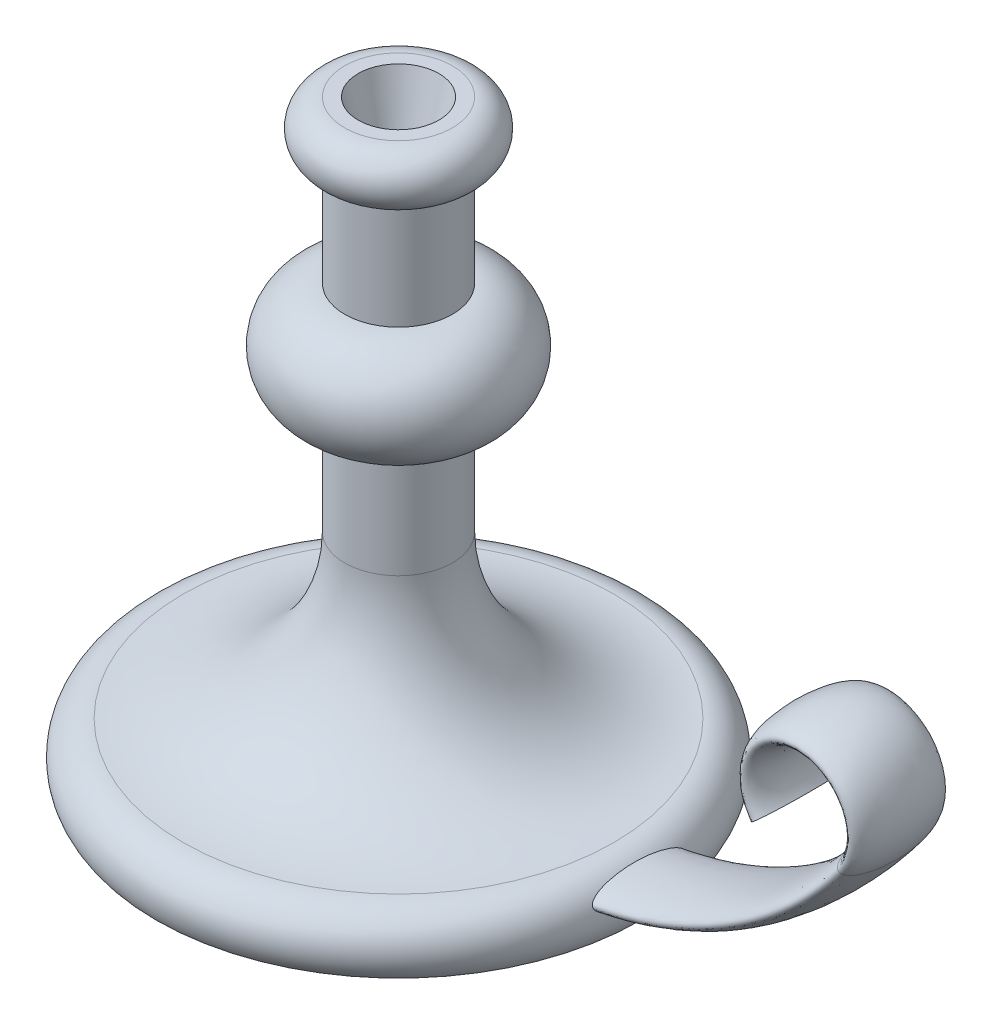
ISO-10303-21;
HEADER;
FILE_DESCRIPTION(('STEP AP214'),'2;1');
FILE_NAME('part.step','',(''),(''),'','','');
FILE_SCHEMA(('AUTOMOTIVE_DESIGN { 1 0 10303 214 1 1 1 1 }'));
ENDSEC;
DATA;
#1=APPLICATION_CONTEXT('core data for automotive mechanical design processes');
#2=APPLICATION_PROTOCOL_DEFINITION('international standard','automotive_design',2000,#1);
#3=PRODUCT_CONTEXT('',#1,'mechanical');
#4=PRODUCT('Part','Part','',(#3));
#5=PRODUCT_RELATED_PRODUCT_CATEGORY('part','',(#4));
#6=PRODUCT_DEFINITION_FORMATION('','',#4);
#7=PRODUCT_DEFINITION_CONTEXT('part definition',#1,'design');
#8=PRODUCT_DEFINITION('design','',#6,#7);
#9=PRODUCT_DEFINITION_SHAPE('','',#8);
#10=(LENGTH_UNIT() NAMED_UNIT(*) SI_UNIT(.MILLI.,.METRE.));
#11=(NAMED_UNIT(*) PLANE_ANGLE_UNIT() SI_UNIT($,.RADIAN.));
#12=(NAMED_UNIT(*) SI_UNIT($,.STERADIAN.) SOLID_ANGLE_UNIT());
#13=UNCERTAINTY_MEASURE_WITH_UNIT(LENGTH_MEASURE(1.E-05),#10,'distance_accuracy_value','');
#14=(GEOMETRIC_REPRESENTATION_CONTEXT(3) GLOBAL_UNCERTAINTY_ASSIGNED_CONTEXT((#13)) GLOBAL_UNIT_ASSIGNED_CONTEXT((#10,
#11,#12)) REPRESENTATION_CONTEXT('',''));
#15=CARTESIAN_POINT('',(0.,0.,0.));
#16=DIRECTION('',(0.,0.,1.));
#17=DIRECTION('',(1.,0.,0.));
#18=AXIS2_PLACEMENT_3D('',#15,#16,#17);
#19=CARTESIAN_POINT('',(0.,0.,0.));
#20=DIRECTION('',(0.,1.,0.));
#21=DIRECTION('',(-1.,0.,0.));
#22=AXIS2_PLACEMENT_3D('',#19,#20,#21);
#23=PLANE('',#22);
#24=CARTESIAN_POINT('',(0.,0.,0.));
#25=DIRECTION('',(0.,1.,0.));
#26=DIRECTION('',(-1.,0.,0.));
#27=AXIS2_PLACEMENT_3D('',#24,#25,#26);
#28=CIRCLE('',#27,90.);
#29=CARTESIAN_POINT('',(-90.,0.,0.));
#30=VERTEX_POINT('',#29);
#31=EDGE_CURVE('E10',#30,#30,#28,.T.);
#32=ORIENTED_EDGE('',*,*,#31,.F.);
#33=EDGE_LOOP('',(#32));
#34=FACE_BOUND('',#33,.T.);
#35=ADVANCED_FACE('F41',(#34),#23,.F.);
#36=CARTESIAN_POINT('',(0.,7.50000000000001,0.));
#37=DIRECTION('',(0.,1.,0.));
#38=DIRECTION('',(-1.,0.,0.));
#39=AXIS2_PLACEMENT_3D('',#36,#37,#38);
#40=TOROIDAL_SURFACE('',#39,80.,12.5);
#41=CARTESIAN_POINT('',(89.6510583005493,12.75205108181,-17.5));
#42=CARTESIAN_POINT('',(89.6712265763763,12.7092993159367,-17.5000023257605));
#43=CARTESIAN_POINT('',(89.6914975939778,12.6666087054796,-17.4977898460739));
#44=CARTESIAN_POINT('',(89.7320874389002,12.5816896807748,-17.489042516584));
#45=CARTESIAN_POINT('',(89.7524062765804,12.5394613805785,-17.4825066235818));
#46=CARTESIAN_POINT('',(89.8132291654997,12.4138963752756,-17.4566823122405));
#47=CARTESIAN_POINT('',(89.8535811376786,12.3317186792987,-17.4311775547004));
#48=CARTESIAN_POINT('',(89.9443453739195,12.1492597562581,-17.3569168690905));
#49=CARTESIAN_POINT('',(89.9942714449003,12.0506619677684,-17.3035566931432));
#50=CARTESIAN_POINT('',(90.0909200299712,11.8627264308283,-17.1801991938799));
#51=CARTESIAN_POINT('',(90.1376341652617,11.7734126121458,-17.1101603369399));
#52=CARTESIAN_POINT('',(90.2223487227239,11.6137425903827,-16.9676062334601));
#53=CARTESIAN_POINT('',(90.2607228043343,11.5423969039705,-16.8963913052705));
#54=CARTESIAN_POINT('',(90.3351432934568,11.4056514014049,-16.747283136507));
#55=CARTESIAN_POINT('',(90.3711876981154,11.3402566821814,-16.6693842801231));
#56=CARTESIAN_POINT('',(90.4412170587481,11.2145880599871,-16.5084804268841));
#57=CARTESIAN_POINT('',(90.4751982003763,11.1543235632542,-16.4254665121922));
#58=CARTESIAN_POINT('',(90.5412559337422,11.0383657298657,-16.2556442319927));
#59=CARTESIAN_POINT('',(90.5733330734153,10.9826710763151,-16.1688369707459));
#60=CARTESIAN_POINT('',(90.640166352336,10.8677355176353,-15.9798901509853));
#61=CARTESIAN_POINT('',(90.6746704292232,10.8090867133352,-15.8773032324495));
#62=CARTESIAN_POINT('',(90.7417471088615,10.6962171927003,-15.6691101574303));
#63=CARTESIAN_POINT('',(90.7743194876529,10.6419969895406,-15.5635036529535));
#64=CARTESIAN_POINT('',(90.8376895317237,10.5374998307884,-15.350067821134));
#65=CARTESIAN_POINT('',(90.8684899267248,10.4872167644531,-15.2422422801763));
#66=CARTESIAN_POINT('',(90.9285408142655,10.3900402750948,-15.0246665691671));
#67=CARTESIAN_POINT('',(90.9577914004017,10.3431466473131,-14.9149165158755));
#68=CARTESIAN_POINT('',(91.0246635628972,10.2368198687245,-14.6559701838914));
#69=CARTESIAN_POINT('',(91.061722080739,10.1785909098826,-14.5061344059227));
#70=CARTESIAN_POINT('',(91.1335870249848,10.0668057083414,-14.2041860189743));
#71=CARTESIAN_POINT('',(91.1683931335286,10.0132501247792,-14.0520730923567));
#72=CARTESIAN_POINT('',(91.2360028455176,9.91018679665473,-13.7458493630192));
#73=CARTESIAN_POINT('',(91.268804169249,9.86068363932454,-13.5917365188692));
#74=CARTESIAN_POINT('',(91.33253603699,9.76533126407919,-13.2819971587816));
#75=CARTESIAN_POINT('',(91.363466460807,9.71948228085988,-13.1263705463385));
#76=CARTESIAN_POINT('',(91.4536983491217,9.58679493993947,-12.6574532423924));
#77=CARTESIAN_POINT('',(91.5104092580997,9.5048633897896,-12.3422680572895));
#78=CARTESIAN_POINT('',(91.61804316962,9.35143040996366,-11.7066721837891));
#79=CARTESIAN_POINT('',(91.6689348181267,9.27998494310533,-11.3862429304555));
#80=CARTESIAN_POINT('',(91.7651540531797,9.14647728412906,-10.7428792345334));
#81=CARTESIAN_POINT('',(91.8104858509958,9.08440798174207,-10.4199468875025));
#82=CARTESIAN_POINT('',(91.8960579449448,8.96842286215425,-9.77201667331602));
#83=CARTESIAN_POINT('',(91.9362990382042,8.91450576818339,-9.44701913792827));
#84=CARTESIAN_POINT('',(92.0131335586377,8.81245634458977,-8.78578527026985));
#85=CARTESIAN_POINT('',(92.0495851107734,8.76454046873927,-8.44949923721547));
#86=CARTESIAN_POINT('',(92.1177117765217,8.67567172897244,-7.7755199410008));
#87=CARTESIAN_POINT('',(92.149386710258,8.63471912726916,-7.43782662533742));
#88=CARTESIAN_POINT('',(92.2081691821812,8.55920799650604,-6.76124044657395));
#89=CARTESIAN_POINT('',(92.2352755023287,8.52465117238614,-6.42234728809433));
#90=CARTESIAN_POINT('',(92.285064650059,8.46151611199518,-5.74367662038519));
#91=CARTESIAN_POINT('',(92.3077473303708,8.43293807476635,-5.40389908209456));
#92=CARTESIAN_POINT('',(92.3692408361073,8.35578329845539,-4.38525038846862));
#93=CARTESIAN_POINT('',(92.4016457810741,8.31559696398435,-3.70533407104075));
#94=CARTESIAN_POINT('',(92.449955590497,8.2558981319597,-2.34403032849602));
#95=CARTESIAN_POINT('',(92.465860050928,8.23638614063071,-1.6626428677666));
#96=CARTESIAN_POINT('',(92.4804897563717,8.21843979721509,-0.382065763209342));
#97=CARTESIAN_POINT('',(92.4810642160644,8.21773657036627,0.217072561317909));
#98=CARTESIAN_POINT('',(92.4696811077622,8.23169750318255,1.41514333089417));
#99=CARTESIAN_POINT('',(92.4577216953988,8.24636392450277,2.01407573266662));
#100=CARTESIAN_POINT('',(92.4211061583442,8.29151919787736,3.21115530177056));
#101=CARTESIAN_POINT('',(92.3964460048784,8.32201307054724,3.8093021595266));
#102=CARTESIAN_POINT('',(92.3340382972497,8.39986031775272,5.00464920124046));
#103=CARTESIAN_POINT('',(92.2962728278945,8.44723677346619,5.60184695928692));
#104=CARTESIAN_POINT('',(92.2070825625492,8.56048283851131,6.79336087687234));
#105=CARTESIAN_POINT('',(92.1556613251941,8.62634763011586,7.3876777461316));
#106=CARTESIAN_POINT('',(92.0675758210724,8.74101037935949,8.27583635543225));
#107=CARTESIAN_POINT('',(92.0363972249988,8.78186378186731,8.57126553167506));
#108=CARTESIAN_POINT('',(91.9702100135923,8.86934722368603,9.16083223411257));
#109=CARTESIAN_POINT('',(91.9352015650172,8.91597701149597,9.45496981596568));
#110=CARTESIAN_POINT('',(91.8611213675158,9.01562702160932,10.041784838053));
#111=CARTESIAN_POINT('',(91.8220478701423,9.06864999530318,10.3344615927682));
#112=CARTESIAN_POINT('',(91.7395603454521,9.18184825692315,10.9178628660955));
#113=CARTESIAN_POINT('',(91.6961457601234,9.24202446452802,11.2085871285917));
#114=CARTESIAN_POINT('',(91.6045750054823,9.37057497037419,11.7876875413059));
#115=CARTESIAN_POINT('',(91.5564157377144,9.43895463220846,12.0760620221725));
#116=CARTESIAN_POINT('',(91.4549376357566,9.58514581931861,12.6490942757877));
#117=CARTESIAN_POINT('',(91.4016256799346,9.66294480479529,12.9337564430836));
#118=CARTESIAN_POINT('',(91.289109463467,9.82987994806847,13.4984684048629));
#119=CARTESIAN_POINT('',(91.2299081312627,9.91901047742157,13.7785204117655));
#120=CARTESIAN_POINT('',(91.1359361687135,10.0632286229579,14.1936070549104));
#121=CARTESIAN_POINT('',(91.1037667778025,10.1130293077085,14.3310742271878));
#122=CARTESIAN_POINT('',(91.037518383188,10.2166235564835,14.6040237965658));
#123=CARTESIAN_POINT('',(91.003439557254,10.270416748954,14.7395063769564));
#124=CARTESIAN_POINT('',(90.9291325884481,10.3889894068518,15.0233964139998));
#125=CARTESIAN_POINT('',(90.8886471249461,10.4543215629754,15.1715076215856));
#126=CARTESIAN_POINT('',(90.8046378649289,10.5917063745145,15.4638092429688));
#127=CARTESIAN_POINT('',(90.7611128337781,10.6637617648678,15.6079980300934));
#128=CARTESIAN_POINT('',(90.6707409931795,10.8155883972647,15.8903447400402));
#129=CARTESIAN_POINT('',(90.6239095890323,10.8953244144061,16.0285263387881));
#130=CARTESIAN_POINT('',(90.526151731605,11.064497480463,16.2972288299763));
#131=CARTESIAN_POINT('',(90.4752295627351,11.153924413122,16.4277574959532));
#132=CARTESIAN_POINT('',(90.380545259539,11.3232611559807,16.6492894395697));
#133=CARTESIAN_POINT('',(90.3377700629072,11.4007460716413,16.742553404177));
#134=CARTESIAN_POINT('',(90.248743327797,11.5644963231068,16.9198004175566));
#135=CARTESIAN_POINT('',(90.2024861403342,11.6507760109945,17.0037678141465));
#136=CARTESIAN_POINT('',(90.130045308952,11.7881732532367,17.1198298896557));
#137=CARTESIAN_POINT('',(90.1052099213753,11.8356521269435,17.1570875073887));
#138=CARTESIAN_POINT('',(90.0545914213625,11.9332624809174,17.2272905359315));
#139=CARTESIAN_POINT('',(90.0288081878403,11.9833943004572,17.2602353933223));
#140=CARTESIAN_POINT('',(89.97643336821,12.0861470981112,17.3208258628925));
#141=CARTESIAN_POINT('',(89.949844532771,12.1387598867451,17.3484875703395));
#142=CARTESIAN_POINT('',(89.8959418658494,12.2464030821131,17.3976478755671));
#143=CARTESIAN_POINT('',(89.8686285045834,12.3014319353167,17.4191503686847));
#144=CARTESIAN_POINT('',(89.8037073514862,12.4334576339659,17.461392049419));
#145=CARTESIAN_POINT('',(89.7658783397269,12.5113347633604,17.4791660539871));
#146=CARTESIAN_POINT('',(89.6902412998411,12.6690177324067,17.4997331914999));
#147=CARTESIAN_POINT('',(89.6524332791195,12.7488219802221,17.50253829068));
#148=CARTESIAN_POINT('',(89.577916046245,12.9079933414515,17.4927779408209));
#149=CARTESIAN_POINT('',(89.5412068784035,12.987360437132,17.4802118727887));
#150=CARTESIAN_POINT('',(89.4697808163885,13.1434607717279,17.4409810156745));
#151=CARTESIAN_POINT('',(89.4350660259798,13.2201911962833,17.4143016312908));
#152=CARTESIAN_POINT('',(89.3552959580974,13.3981815957079,17.3366327077017));
#153=CARTESIAN_POINT('',(89.3113771643573,13.4975711590859,17.2802448547764));
#154=CARTESIAN_POINT('',(89.2282993839269,13.6875272252587,17.1511392902752));
#155=CARTESIAN_POINT('',(89.1891597031921,13.7780576658709,17.0783585173073));
#156=CARTESIAN_POINT('',(89.1193050161008,13.9409349439343,16.9302921195295));
#157=CARTESIAN_POINT('',(89.0881372013215,14.0141841015015,16.856187362858));
#158=CARTESIAN_POINT('',(89.0287414929703,14.1545602644834,16.7015966854578));
#159=CARTESIAN_POINT('',(89.0005091294225,14.2216965583286,16.621120805622));
#160=CARTESIAN_POINT('',(88.9463858132425,14.3509486820356,16.4550736615827));
#161=CARTESIAN_POINT('',(88.9205029613336,14.4130470692596,16.3694863387971));
#162=CARTESIAN_POINT('',(88.8707923497112,14.5326798379124,16.1945867260726));
#163=CARTESIAN_POINT('',(88.8469652924514,14.5902126587779,16.1052731782471));
#164=CARTESIAN_POINT('',(88.8009162427218,14.70162843937,15.923187786771));
#165=CARTESIAN_POINT('',(88.7787054915218,14.7554856997481,15.8303974769188));
#166=CARTESIAN_POINT('',(88.7358010812391,14.8596392722484,15.6424886668355));
#167=CARTESIAN_POINT('',(88.7151076880761,14.9099349601462,15.5473697623919));
#168=CARTESIAN_POINT('',(88.6549323320097,15.0562330323469,15.2589640485164));
#169=CARTESIAN_POINT('',(88.6174129301236,15.1475061966202,15.0628635439216));
#170=CARTESIAN_POINT('',(88.5463644133726,15.3199831835958,14.6654752601948));
#171=CARTESIAN_POINT('',(88.5128385158133,15.4011788897279,14.464183455468));
#172=CARTESIAN_POINT('',(88.4488481402778,15.5555209000738,14.0570217288605));
#173=CARTESIAN_POINT('',(88.4183981036597,15.6286293741319,13.8511352930737));
#174=CARTESIAN_POINT('',(88.3601840560581,15.7675983985148,13.4368230147419));
#175=CARTESIAN_POINT('',(88.3324172333339,15.8334665461583,13.2284000939023));
#176=CARTESIAN_POINT('',(88.2791299992412,15.9589976234398,12.8094770726386));
#177=CARTESIAN_POINT('',(88.2536090449183,16.0186620535059,12.5989774880235));
#178=CARTESIAN_POINT('',(88.1982344930368,16.1471029156387,12.1223084699176));
#179=CARTESIAN_POINT('',(88.1689393224488,16.2143140206529,11.8556532984564));
#180=CARTESIAN_POINT('',(88.1129856341209,16.3413087475923,11.32029247946));
#181=CARTESIAN_POINT('',(88.0863273771435,16.401091635096,11.0515866319596));
#182=CARTESIAN_POINT('',(88.0353560515521,16.5141076951915,10.512449353477));
#183=CARTESIAN_POINT('',(88.0110441171801,16.5673377034313,10.2420171546333));
#184=CARTESIAN_POINT('',(87.9645888326395,16.6678802631918,9.69986509650254));
#185=CARTESIAN_POINT('',(87.942445583794,16.7151925382588,9.42814517767301));
#186=CARTESIAN_POINT('',(87.8791931353406,16.848803414368,8.61307309841335));
#187=CARTESIAN_POINT('',(87.8411079160796,16.9271130095915,8.06816406130699));
#188=CARTESIAN_POINT('',(87.7725026626888,17.065425061432,6.97573167484753));
#189=CARTESIAN_POINT('',(87.7419809439837,17.1254315952739,6.42820893536919));
#190=CARTESIAN_POINT('',(87.688437148567,17.2290105025569,5.33277171265303));
#191=CARTESIAN_POINT('',(87.665394772422,17.272627410195,4.78486240392271));
#192=CARTESIAN_POINT('',(87.6267325911382,17.3449712904451,3.68778147026049));
#193=CARTESIAN_POINT('',(87.6111131896588,17.37369745331,3.13860977831189));
#194=CARTESIAN_POINT('',(87.5873818658684,17.4170730791321,2.03926559965164));
#195=CARTESIAN_POINT('',(87.5792738702903,17.4317151795255,1.48909273996275));
#196=CARTESIAN_POINT('',(87.5706445209295,17.447292477337,0.388508308213518));
#197=CARTESIAN_POINT('',(87.5701229863986,17.4482280013157,-0.161903257847173));
#198=CARTESIAN_POINT('',(87.5766702495203,17.4364187049648,-1.26244662129562));
#199=CARTESIAN_POINT('',(87.5837378231694,17.4236760907037,-1.81257844948553));
#200=CARTESIAN_POINT('',(87.6054034213999,17.38417059398,-2.91221320839364));
#201=CARTESIAN_POINT('',(87.6200016882678,17.3574072604257,-3.46171611830742));
#202=CARTESIAN_POINT('',(87.656635539229,17.2891206133141,-4.55942020825845));
#203=CARTESIAN_POINT('',(87.6786692355825,17.2476010459926,-5.10762168317005));
#204=CARTESIAN_POINT('',(87.7301185692671,17.1485784152629,-6.20221544743582));
#205=CARTESIAN_POINT('',(87.7595335836244,17.0910767006831,-6.74860788552928));
#206=CARTESIAN_POINT('',(87.8107439370238,16.9884633945765,-7.59037446394614));
#207=CARTESIAN_POINT('',(87.8299041969617,16.9496444252812,-7.88668568365958));
#208=CARTESIAN_POINT('',(87.8705031609152,16.8662783987937,-8.47834251002562));
#209=CARTESIAN_POINT('',(87.8919417994473,16.8217315062214,-8.773688144179));
#210=CARTESIAN_POINT('',(87.9371857964046,16.7264082419636,-9.36307646375651));
#211=CARTESIAN_POINT('',(87.9609902428907,16.675634268855,-9.65711960594327));
#212=CARTESIAN_POINT('',(88.0111296720519,16.5671845859349,-10.2437143313487));
#213=CARTESIAN_POINT('',(88.0374645718337,16.5095091021898,-10.5362659630963));
#214=CARTESIAN_POINT('',(88.0846330593871,16.4047836231311,-11.0323849689617));
#215=CARTESIAN_POINT('',(88.1047609673391,16.3597040156183,-11.2364360478867));
#216=CARTESIAN_POINT('',(88.1465057393758,16.2653563168167,-11.6434125615981));
#217=CARTESIAN_POINT('',(88.1681225586755,16.2160883514985,-11.8463380300435));
#218=CARTESIAN_POINT('',(88.2130243789531,16.1128698969553,-12.2509867229222));
#219=CARTESIAN_POINT('',(88.236310688228,16.0589157282247,-12.452708867278));
#220=CARTESIAN_POINT('',(88.2847525446554,15.9457941931939,-12.8544603086905));
#221=CARTESIAN_POINT('',(88.3099080308786,15.8866269968106,-13.0544896606904));
#222=CARTESIAN_POINT('',(88.3622479777616,15.7626774858655,-13.4514075267458));
#223=CARTESIAN_POINT('',(88.3894214499192,15.6979253104458,-13.6483068497736));
#224=CARTESIAN_POINT('',(88.4463002453198,15.561642136376,-14.03937342676));
#225=CARTESIAN_POINT('',(88.4760053286474,15.4901117800078,-14.233540937579));
#226=CARTESIAN_POINT('',(88.5384695650881,15.3391239502718,-14.618093014818));
#227=CARTESIAN_POINT('',(88.5712260714796,15.2596733425962,-14.8084806890219));
#228=CARTESIAN_POINT('',(88.6405752840355,15.0911856292365,-15.1842342934778));
#229=CARTESIAN_POINT('',(88.6771663156325,15.0021527077688,-15.3696023716873));
#230=CARTESIAN_POINT('',(88.7362144589951,14.8586435187571,-15.6441726990023));
#231=CARTESIAN_POINT('',(88.7568325397602,14.8085607108884,-15.736071360476));
#232=CARTESIAN_POINT('',(88.7995796136574,14.7048783902582,-15.9174958092286));
#233=CARTESIAN_POINT('',(88.8217083411884,14.6512794957573,-16.0070220098093));
#234=CARTESIAN_POINT('',(88.8677414205822,14.540054344219,-16.1831459561719));
#235=CARTESIAN_POINT('',(88.8916466370441,14.4824261269686,-16.2697422457627));
#236=CARTESIAN_POINT('',(88.9415299990265,14.3626040269357,-16.4390912391307));
#237=CARTESIAN_POINT('',(88.9675075783756,14.3004113915252,-16.5218449829867));
#238=CARTESIAN_POINT('',(89.0143729907289,14.1887624667248,-16.6600524633883));
#239=CARTESIAN_POINT('',(89.0346733729725,14.1405597072453,-16.7167105558527));
#240=CARTESIAN_POINT('',(89.0767193165274,14.0411526477579,-16.8267554094284));
#241=CARTESIAN_POINT('',(89.0984652133873,13.9899476511658,-16.8801414054184));
#242=CARTESIAN_POINT('',(89.1660708981076,13.8315663385635,-17.0340633222569));
#243=CARTESIAN_POINT('',(89.2144111590297,13.7193541157068,-17.1287097095236));
#244=CARTESIAN_POINT('',(89.3001688142906,13.5231566666717,-17.2633267891176));
#245=CARTESIAN_POINT('',(89.3353485789106,13.4433433398243,-17.3107670763825));
#246=CARTESIAN_POINT('',(89.4089110914372,13.2782730902645,-17.3915891546258));
#247=CARTESIAN_POINT('',(89.4472863318717,13.1930290314804,-17.4250028420385));
#248=CARTESIAN_POINT('',(89.5133756250969,13.0480429600783,-17.4661950175617));
#249=CARTESIAN_POINT('',(89.5403552234057,12.9893227872872,-17.4788112932616));
#250=CARTESIAN_POINT('',(89.5951764206732,12.8710460603942,-17.4957123730654));
#251=CARTESIAN_POINT('',(89.6230180620564,12.8114894652078,-17.4999967664623));
#252=CARTESIAN_POINT('',(89.6510583005493,12.75205108181,-17.5));
#253=B_SPLINE_CURVE_WITH_KNOTS('',3,(#41,#42,#43,#44,#45,#46,#47,#48,#49,#50,#51,#52,#53,#54,
#55,#56,#57,#58,#59,#60,#61,#62,#63,#64,#65,#66,#67,#68,#69,#70,#71,#72,#73,#74,#75,#76,#77,#78,
#79,#80,#81,#82,#83,#84,#85,#86,#87,#88,#89,#90,#91,#92,#93,#94,#95,#96,#97,#98,#99,#100,#101,
#102,#103,#104,#105,#106,#107,#108,#109,#110,#111,#112,#113,#114,#115,#116,#117,#118,#119,#120,
#121,#122,#123,#124,#125,#126,#127,#128,#129,#130,#131,#132,#133,#134,#135,#136,#137,#138,#139,
#140,#141,#142,#143,#144,#145,#146,#147,#148,#149,#150,#151,#152,#153,#154,#155,#156,#157,#158,
#159,#160,#161,#162,#163,#164,#165,#166,#167,#168,#169,#170,#171,#172,#173,#174,#175,#176,#177,
#178,#179,#180,#181,#182,#183,#184,#185,#186,#187,#188,#189,#190,#191,#192,#193,#194,#195,#196,
#197,#198,#199,#200,#201,#202,#203,#204,#205,#206,#207,#208,#209,#210,#211,#212,#213,#214,#215,
#216,#217,#218,#219,#220,#221,#222,#223,#224,#225,#226,#227,#228,#229,#230,#231,#232,#233,#234,
#235,#236,#237,#238,#239,#240,#241,#242,#243,#244,#245,#246,#247,#248,#249,#250,#251,#252),
.UNSPECIFIED.,.T.,.F.,(4,2,2,2,2,2,2,2,2,2,2,2,2,2,2,2,2,2,2,2,2,2,2,2,2,2,2,2,2,2,2,2,2,2,2,2,
2,2,2,2,2,2,2,2,2,2,2,2,2,2,2,2,2,2,2,2,2,2,2,2,2,2,2,2,2,2,2,2,2,2,2,2,2,2,2,2,2,2,2,2,2,2,2,2,
2,2,2,2,2,2,2,2,2,2,2,2,2,2,2,2,2,2,2,2,2,4),(0.,0.141736620842264,0.283507453877193,
0.567176930031786,0.933324285768272,1.30039314438852,1.62351677543976,1.94691460317356,
2.27089315157966,2.59477800854903,2.96392495037514,3.33311460751692,3.70171940167208,
4.07030190947377,4.56508745905712,5.05994268123993,5.55535053501553,6.05079018164716,
7.0421302354246,8.0385822558051,9.03427479730286,10.029811235068,11.054591751925,
12.0794108499664,13.1045027445974,14.1296287605531,16.1746478814693,18.2197170748391,
20.0168131504106,21.8141737071417,23.6121047521981,25.412503345571,27.2124332223523,
28.1119640060957,29.0114556384704,29.911335769781,30.811331722493,31.7119193519239,
32.6113209607327,33.5102775642821,33.9593358851011,34.4083524675651,34.9087798833656,
35.4094117624888,35.9078480472674,36.4057689418885,36.7910277909983,37.1769257224444,
37.3725495288336,37.5681984133603,37.7632413927641,37.9581607453334,38.2220860167362,
38.4858002730063,38.7495251493332,39.0135232917402,39.3787076055704,39.7453214841679,
40.0711215871068,40.3964180772939,40.7227966163264,41.0492862390432,41.3778641814797,
41.7064995708077,42.3646080452285,43.0232431792219,43.6848394432678,44.3457347264301,
45.0064697921283,45.8359773654666,46.6655668863756,47.4955554533719,48.3255827797732,
49.9805846583292,51.6352175957972,53.2853214516523,54.9355150294633,56.5865707919731,
58.2375872178454,59.8883374007582,61.5391406968865,63.1895251946837,64.8397704489924,
65.7380875251899,66.636378789616,67.5343251262205,68.4322420576686,69.0620146261526,
69.6917682600418,70.322020911916,70.952253028514,71.5792747011389,72.2062370182206,
72.8326605007099,73.4588115502466,73.7787506276887,74.0986335977774,74.4186732843102,
74.7386258331966,74.9698114682864,75.2010509573804,75.6621788485268,75.9591507272364,
76.255443586091,76.4524922972461,76.6495507213608),.UNSPECIFIED.);
#254=CARTESIAN_POINT('',(89.6510583005493,12.75205108181,-17.5));
#255=VERTEX_POINT('',#254);
#256=EDGE_CURVE('E44',#255,#255,#253,.T.);
#257=ORIENTED_EDGE('',*,*,#256,.T.);
#258=EDGE_LOOP('',(#257));
#259=FACE_BOUND('',#258,.T.);
#260=CARTESIAN_POINT('',(0.,20.,0.));
#261=DIRECTION('',(0.,1.,0.));
#262=DIRECTION('',(-1.,0.,0.));
#263=AXIS2_PLACEMENT_3D('',#260,#261,#262);
#264=CIRCLE('',#263,80.);
#265=CARTESIAN_POINT('',(-80.,20.,0.));
#266=VERTEX_POINT('',#265);
#267=EDGE_CURVE('E53',#266,#266,#264,.T.);
#268=ORIENTED_EDGE('',*,*,#267,.F.);
#269=EDGE_LOOP('',(#268));
#270=FACE_BOUND('',#269,.T.);
#271=ORIENTED_EDGE('',*,*,#31,.T.);
#272=EDGE_LOOP('',(#271));
#273=FACE_BOUND('',#272,.T.);
#274=ADVANCED_FACE('F133',(#259,#270,#273),#40,.T.);
#275=CARTESIAN_POINT('',(0.,80.,0.));
#276=DIRECTION('',(0.,1.,0.));
#277=DIRECTION('',(-1.,0.,0.));
#278=AXIS2_PLACEMENT_3D('',#275,#276,#277);
#279=TOROIDAL_SURFACE('',#278,80.,60.);
#280=CARTESIAN_POINT('',(0.,80.,0.));
#281=DIRECTION('',(0.,1.,0.));
#282=DIRECTION('',(-1.,0.,0.));
#283=AXIS2_PLACEMENT_3D('',#280,#281,#282);
#284=CIRCLE('',#283,20.);
#285=CARTESIAN_POINT('',(-20.,80.,0.));
#286=VERTEX_POINT('',#285);
#287=EDGE_CURVE('E58',#286,#286,#284,.T.);
#288=ORIENTED_EDGE('',*,*,#287,.F.);
#289=EDGE_LOOP('',(#288));
#290=FACE_BOUND('',#289,.T.);
#291=ORIENTED_EDGE('',*,*,#267,.T.);
#292=EDGE_LOOP('',(#291));
#293=FACE_BOUND('',#292,.T.);
#294=ADVANCED_FACE('F127',(#290,#293),#279,.F.);
#295=CARTESIAN_POINT('',(0.,220.,0.));
#296=DIRECTION('',(0.,1.,0.));
#297=DIRECTION('',(-1.,0.,0.));
#298=AXIS2_PLACEMENT_3D('',#295,#296,#297);
#299=CYLINDRICAL_SURFACE('',#298,20.);
#300=CARTESIAN_POINT('',(0.,120.,0.));
#301=DIRECTION('',(0.,1.,0.));
#302=DIRECTION('',(-1.,0.,0.));
#303=AXIS2_PLACEMENT_3D('',#300,#301,#302);
#304=CIRCLE('',#303,20.);
#305=CARTESIAN_POINT('',(-20.,120.,0.));
#306=VERTEX_POINT('',#305);
#307=EDGE_CURVE('E64',#306,#306,#304,.T.);
#308=ORIENTED_EDGE('',*,*,#307,.F.);
#309=EDGE_LOOP('',(#308));
#310=FACE_BOUND('',#309,.T.);
#311=ORIENTED_EDGE('',*,*,#287,.T.);
#312=EDGE_LOOP('',(#311));
#313=FACE_BOUND('',#312,.T.);
#314=ADVANCED_FACE('F121',(#310,#313),#299,.T.);
#315=CARTESIAN_POINT('',(0.,140.,0.));
#316=DIRECTION('',(0.,1.,0.));
#317=DIRECTION('',(-1.,0.,0.));
#318=AXIS2_PLACEMENT_3D('',#315,#316,#317);
#319=TOROIDAL_SURFACE('',#318,20.,20.);
#320=CARTESIAN_POINT('',(0.,160.,0.));
#321=DIRECTION('',(0.,1.,0.));
#322=DIRECTION('',(-1.,0.,0.));
#323=AXIS2_PLACEMENT_3D('',#320,#321,#322);
#324=CIRCLE('',#323,20.);
#325=CARTESIAN_POINT('',(-20.,160.,0.));
#326=VERTEX_POINT('',#325);
#327=EDGE_CURVE('E68',#326,#326,#324,.T.);
#328=ORIENTED_EDGE('',*,*,#327,.F.);
#329=EDGE_LOOP('',(#328));
#330=FACE_BOUND('',#329,.T.);
#331=ORIENTED_EDGE('',*,*,#307,.T.);
#332=EDGE_LOOP('',(#331));
#333=FACE_BOUND('',#332,.T.);
#334=ADVANCED_FACE('F115',(#330,#333),#319,.T.);
#335=CARTESIAN_POINT('',(0.,220.,0.));
#336=DIRECTION('',(0.,1.,0.));
#337=DIRECTION('',(-1.,0.,0.));
#338=AXIS2_PLACEMENT_3D('',#335,#336,#337);
#339=CYLINDRICAL_SURFACE('',#338,20.);
#340=CARTESIAN_POINT('',(0.,200.,0.));
#341=DIRECTION('',(0.,1.,0.));
#342=DIRECTION('',(-1.,0.,0.));
#343=AXIS2_PLACEMENT_3D('',#340,#341,#342);
#344=CIRCLE('',#343,20.);
#345=CARTESIAN_POINT('',(-20.,200.,0.));
#346=VERTEX_POINT('',#345);
#347=EDGE_CURVE('E72',#346,#346,#344,.T.);
#348=ORIENTED_EDGE('',*,*,#347,.F.);
#349=EDGE_LOOP('',(#348));
#350=FACE_BOUND('',#349,.T.);
#351=ORIENTED_EDGE('',*,*,#327,.T.);
#352=EDGE_LOOP('',(#351));
#353=FACE_BOUND('',#352,.T.);
#354=ADVANCED_FACE('F109',(#350,#353),#339,.T.);
#355=CARTESIAN_POINT('',(0.,210.,0.));
#356=DIRECTION('',(0.,1.,0.));
#357=DIRECTION('',(-1.,0.,0.));
#358=AXIS2_PLACEMENT_3D('',#355,#356,#357);
#359=TOROIDAL_SURFACE('',#358,20.,10.);
#360=CARTESIAN_POINT('',(0.,220.,0.));
#361=DIRECTION('',(0.,1.,0.));
#362=DIRECTION('',(-1.,0.,0.));
#363=AXIS2_PLACEMENT_3D('',#360,#361,#362);
#364=CIRCLE('',#363,20.);
#365=CARTESIAN_POINT('',(-20.,220.,0.));
#366=VERTEX_POINT('',#365);
#367=EDGE_CURVE('E76',#366,#366,#364,.T.);
#368=ORIENTED_EDGE('',*,*,#367,.F.);
#369=EDGE_LOOP('',(#368));
#370=FACE_BOUND('',#369,.T.);
#371=ORIENTED_EDGE('',*,*,#347,.T.);
#372=EDGE_LOOP('',(#371));
#373=FACE_BOUND('',#372,.T.);
#374=ADVANCED_FACE('F103',(#370,#373),#359,.T.);
#375=CARTESIAN_POINT('',(20.,220.,0.));
#376=DIRECTION('',(0.,-1.,0.));
#377=DIRECTION('',(1.,0.,0.));
#378=AXIS2_PLACEMENT_3D('',#375,#376,#377);
#379=PLANE('',#378);
#380=CARTESIAN_POINT('',(0.,220.,0.));
#381=DIRECTION('',(0.,1.,0.));
#382=DIRECTION('',(-1.,0.,0.));
#383=AXIS2_PLACEMENT_3D('',#380,#381,#382);
#384=CIRCLE('',#383,15.);
#385=CARTESIAN_POINT('',(-15.,220.,0.));
#386=VERTEX_POINT('',#385);
#387=EDGE_CURVE('E92',#386,#386,#384,.T.);
#388=ORIENTED_EDGE('',*,*,#387,.F.);
#389=EDGE_LOOP('',(#388));
#390=FACE_BOUND('',#389,.T.);
#391=ORIENTED_EDGE('',*,*,#367,.T.);
#392=EDGE_LOOP('',(#391));
#393=FACE_BOUND('',#392,.T.);
#394=ADVANCED_FACE('F99',(#390,#393),#379,.F.);
#395=CARTESIAN_POINT('',(61.0496328223303,10.,-17.5));
#396=CARTESIAN_POINT('',(109.156869799609,10.,-17.5));
#397=CARTESIAN_POINT('',(152.185290635963,31.5142104181772,-17.5));
#398=CARTESIAN_POINT('',(181.04963282233,70.,-17.5));
#399=CARTESIAN_POINT('',(61.0496328223303,20.,-17.5));
#400=CARTESIAN_POINT('',(105.94972066779,20.,-17.5));
#401=CARTESIAN_POINT('',(146.109580115054,40.0799297236321,-17.5));
#402=CARTESIAN_POINT('',(173.04963282233,76.,-17.5));
#403=CARTESIAN_POINT('',(61.0496328223303,20.,17.5));
#404=CARTESIAN_POINT('',(105.94972066779,20.,17.5));
#405=CARTESIAN_POINT('',(146.109580115054,40.0799297236321,17.5));
#406=CARTESIAN_POINT('',(173.04963282233,76.,17.5));
#407=CARTESIAN_POINT('',(61.0496328223303,10.,17.5));
#408=CARTESIAN_POINT('',(109.156869799609,10.,17.5));
#409=CARTESIAN_POINT('',(152.185290635963,31.5142104181772,17.5));
#410=CARTESIAN_POINT('',(181.04963282233,70.,17.5));
#411=CARTESIAN_POINT('',(61.0496328223303,0.,17.5));
#412=CARTESIAN_POINT('',(112.364018931427,0.,17.5));
#413=CARTESIAN_POINT('',(158.261001156872,22.9484911127224,17.5));
#414=CARTESIAN_POINT('',(189.04963282233,64.,17.5));
#415=CARTESIAN_POINT('',(61.0496328223303,0.,-17.5));
#416=CARTESIAN_POINT('',(112.364018931427,0.,-17.5));
#417=CARTESIAN_POINT('',(158.261001156872,22.9484911127224,-17.5));
#418=CARTESIAN_POINT('',(189.04963282233,64.,-17.5));
#419=CARTESIAN_POINT('',(61.0496328223303,10.,-17.5));
#420=CARTESIAN_POINT('',(109.156869799609,10.,-17.5));
#421=CARTESIAN_POINT('',(152.185290635963,31.5142104181772,-17.5));
#422=CARTESIAN_POINT('',(181.04963282233,70.,-17.5));
#423=(BOUNDED_SURFACE() B_SPLINE_SURFACE(3,3,((#395,#396,#397,#398),(#399,#400,#401,#402),(#403,
#404,#405,#406),(#407,#408,#409,#410),(#411,#412,#413,#414),(#415,#416,#417,#418),(#419,#420,
#421,#422)),.UNSPECIFIED.,.T.,.F.,.F.) B_SPLINE_SURFACE_WITH_KNOTS((4,3,4),(4,4),(0.,0.5,1.),
(0.,1.),.UNSPECIFIED.) GEOMETRIC_REPRESENTATION_ITEM() RATIONAL_B_SPLINE_SURFACE(((1.,
0.929618127333277,0.929618127333277,1.),(0.333333333333333,0.309872709111092,0.309872709111092,
0.333333333333333),(0.333333333333333,0.309872709111092,0.309872709111092,0.333333333333333),
(1.,0.929618127333277,0.929618127333277,1.),(0.333333333333333,0.309872709111092,
0.309872709111092,0.333333333333333),(0.333333333333333,0.309872709111092,0.309872709111092,
0.333333333333333),(1.,0.929618127333277,0.929618127333277,1.))) REPRESENTATION_ITEM('') SURFACE());
#424=CARTESIAN_POINT('',(181.04963282233,70.,0.));
#425=DIRECTION('',(0.6,0.8,0.));
#426=DIRECTION('',(0.,0.,-1.));
#427=AXIS2_PLACEMENT_3D('',#424,#425,#426);
#428=ELLIPSE('',#427,17.5,5.);
#429=CARTESIAN_POINT('',(181.04963282233,70.,-17.5));
#430=VERTEX_POINT('',#429);
#431=EDGE_CURVE('E84',#430,#430,#428,.T.);
#432=ORIENTED_EDGE('',*,*,#431,.F.);
#433=EDGE_LOOP('',(#432));
#434=FACE_BOUND('',#433,.T.);
#435=ORIENTED_EDGE('',*,*,#256,.F.);
#436=EDGE_LOOP('',(#435));
#437=FACE_BOUND('',#436,.T.);
#438=ADVANCED_FACE('F102',(#434,#437),#423,.T.);
#439=CARTESIAN_POINT('',(149.04963282233,70.,0.));
#440=DIRECTION('',(0.6,-0.8,0.));
#441=DIRECTION('',(0.,0.,-1.));
#442=AXIS2_PLACEMENT_3D('',#439,#440,#441);
#443=PLANE('',#442);
#444=CARTESIAN_POINT('',(149.04963282233,70.,0.));
#445=DIRECTION('',(0.6,-0.8,0.));
#446=DIRECTION('',(0.,0.,-1.));
#447=AXIS2_PLACEMENT_3D('',#444,#445,#446);
#448=ELLIPSE('',#447,17.5,5.);
#449=CARTESIAN_POINT('',(149.04963282233,70.,-17.5));
#450=VERTEX_POINT('',#449);
#451=EDGE_CURVE('E80',#450,#450,#448,.T.);
#452=ORIENTED_EDGE('',*,*,#451,.T.);
#453=EDGE_LOOP('',(#452));
#454=FACE_BOUND('',#453,.T.);
#455=ADVANCED_FACE('F146',(#454),#443,.T.);
#456=CARTESIAN_POINT('',(181.04963282233,70.,-17.5));
#457=CARTESIAN_POINT('',(192.38089574232,85.1083505599865,-17.5));
#458=CARTESIAN_POINT('',(183.935071022314,102.,-17.5));
#459=CARTESIAN_POINT('',(165.04963282233,102.,-17.5));
#460=CARTESIAN_POINT('',(146.164194622347,102.,-17.5));
#461=CARTESIAN_POINT('',(137.71836990234,85.1083505599865,-17.5));
#462=CARTESIAN_POINT('',(149.04963282233,70.,-17.5));
#463=CARTESIAN_POINT('',(173.04963282233,76.,-17.5));
#464=CARTESIAN_POINT('',(178.715264282325,83.5541752799933,-17.5));
#465=CARTESIAN_POINT('',(174.492351922322,92.,-17.5));
#466=CARTESIAN_POINT('',(165.04963282233,92.,-17.5));
#467=CARTESIAN_POINT('',(155.606913722339,92.,-17.5));
#468=CARTESIAN_POINT('',(151.384001362335,83.5541752799933,-17.5));
#469=CARTESIAN_POINT('',(157.04963282233,76.,-17.5));
#470=CARTESIAN_POINT('',(173.04963282233,76.,17.5));
#471=CARTESIAN_POINT('',(178.715264282325,83.5541752799933,17.5));
#472=CARTESIAN_POINT('',(174.492351922322,92.,17.5));
#473=CARTESIAN_POINT('',(165.04963282233,92.,17.5));
#474=CARTESIAN_POINT('',(155.606913722339,92.,17.5));
#475=CARTESIAN_POINT('',(151.384001362335,83.5541752799933,17.5));
#476=CARTESIAN_POINT('',(157.04963282233,76.,17.5));
#477=CARTESIAN_POINT('',(181.04963282233,70.,17.5));
#478=CARTESIAN_POINT('',(192.38089574232,85.1083505599865,17.5));
#479=CARTESIAN_POINT('',(183.935071022314,102.,17.5));
#480=CARTESIAN_POINT('',(165.04963282233,102.,17.5));
#481=CARTESIAN_POINT('',(146.164194622347,102.,17.5));
#482=CARTESIAN_POINT('',(137.71836990234,85.1083505599865,17.5));
#483=CARTESIAN_POINT('',(149.04963282233,70.,17.5));
#484=CARTESIAN_POINT('',(189.04963282233,64.,17.5));
#485=CARTESIAN_POINT('',(206.046527202315,86.6625258399798,17.5));
#486=CARTESIAN_POINT('',(193.377790122305,112.,17.5));
#487=CARTESIAN_POINT('',(165.04963282233,112.,17.5));
#488=CARTESIAN_POINT('',(136.721475522356,112.,17.5));
#489=CARTESIAN_POINT('',(124.052738442346,86.6625258399798,17.5));
#490=CARTESIAN_POINT('',(141.04963282233,64.,17.5));
#491=CARTESIAN_POINT('',(189.04963282233,64.,-17.5));
#492=CARTESIAN_POINT('',(206.046527202315,86.6625258399798,-17.5));
#493=CARTESIAN_POINT('',(193.377790122305,112.,-17.5));
#494=CARTESIAN_POINT('',(165.04963282233,112.,-17.5));
#495=CARTESIAN_POINT('',(136.721475522356,112.,-17.5));
#496=CARTESIAN_POINT('',(124.052738442346,86.6625258399798,-17.5));
#497=CARTESIAN_POINT('',(141.04963282233,64.,-17.5));
#498=CARTESIAN_POINT('',(181.04963282233,70.,-17.5));
#499=CARTESIAN_POINT('',(192.38089574232,85.1083505599865,-17.5));
#500=CARTESIAN_POINT('',(183.935071022314,102.,-17.5));
#501=CARTESIAN_POINT('',(165.04963282233,102.,-17.5));
#502=CARTESIAN_POINT('',(146.164194622347,102.,-17.5));
#503=CARTESIAN_POINT('',(137.71836990234,85.1083505599865,-17.5));
#504=CARTESIAN_POINT('',(149.04963282233,70.,-17.5));
#505=(BOUNDED_SURFACE() B_SPLINE_SURFACE(3,3,((#456,#457,#458,#459,#460,#461,#462),(#463,#464,
#465,#466,#467,#468,#469),(#470,#471,#472,#473,#474,#475,#476),(#477,#478,#479,#480,#481,#482,
#483),(#484,#485,#486,#487,#488,#489,#490),(#491,#492,#493,#494,#495,#496,#497),(#498,#499,#500,
#501,#502,#503,#504)),.UNSPECIFIED.,.T.,.F.,.F.) B_SPLINE_SURFACE_WITH_KNOTS((4,3,4),(4,3,4),
(0.,0.5,1.),(0.,0.5,1.),
.UNSPECIFIED.) GEOMETRIC_REPRESENTATION_ITEM() RATIONAL_B_SPLINE_SURFACE(((1.,0.631475730333305,
0.631475730333305,1.,0.631475730333305,0.631475730333305,1.),(0.333333333333333,
0.210491910111102,0.210491910111102,0.333333333333333,0.210491910111102,0.210491910111102,
0.333333333333333),(0.333333333333333,0.210491910111102,0.210491910111102,0.333333333333333,
0.210491910111102,0.210491910111102,0.333333333333333),(1.,0.631475730333305,0.631475730333305,
1.,0.631475730333305,0.631475730333305,1.),(0.333333333333333,0.210491910111102,
0.210491910111102,0.333333333333333,0.210491910111102,0.210491910111102,0.333333333333333),
(0.333333333333333,0.210491910111102,0.210491910111102,0.333333333333333,0.210491910111102,
0.210491910111102,0.333333333333333),(1.,0.631475730333305,0.631475730333305,1.,
0.631475730333305,0.631475730333305,1.))) REPRESENTATION_ITEM('') SURFACE());
#506=ORIENTED_EDGE('',*,*,#451,.F.);
#507=EDGE_LOOP('',(#506));
#508=FACE_BOUND('',#507,.T.);
#509=ORIENTED_EDGE('',*,*,#431,.T.);
#510=EDGE_LOOP('',(#509));
#511=FACE_BOUND('',#510,.T.);
#512=ADVANCED_FACE('F149',(#508,#511),#505,.T.);
#513=CARTESIAN_POINT('',(0.,220.,0.));
#514=DIRECTION('',(0.,1.,0.));
#515=DIRECTION('',(-1.,0.,0.));
#516=AXIS2_PLACEMENT_3D('',#513,#514,#515);
#517=CONICAL_SURFACE('',#516,15.,0.26179938779915);
#518=CARTESIAN_POINT('',(0.,195.,0.));
#519=DIRECTION('',(0.,1.,0.));
#520=DIRECTION('',(-1.,0.,0.));
#521=AXIS2_PLACEMENT_3D('',#518,#519,#520);
#522=CIRCLE('',#521,8.30127018922192);
#523=CARTESIAN_POINT('',(-8.30127018922193,195.,0.));
#524=VERTEX_POINT('',#523);
#525=EDGE_CURVE('E88',#524,#524,#522,.T.);
#526=ORIENTED_EDGE('',*,*,#525,.F.);
#527=EDGE_LOOP('',(#526));
#528=FACE_BOUND('',#527,.T.);
#529=ORIENTED_EDGE('',*,*,#387,.T.);
#530=EDGE_LOOP('',(#529));
#531=FACE_BOUND('',#530,.T.);
#532=ADVANCED_FACE('F97',(#528,#531),#517,.F.);
#533=CARTESIAN_POINT('',(0.,195.,0.));
#534=DIRECTION('',(0.,1.,0.));
#535=DIRECTION('',(-1.,0.,0.));
#536=AXIS2_PLACEMENT_3D('',#533,#534,#535);
#537=PLANE('',#536);
#538=ORIENTED_EDGE('',*,*,#525,.T.);
#539=EDGE_LOOP('',(#538));
#540=FACE_BOUND('',#539,.T.);
#541=ADVANCED_FACE('F173',(#540),#537,.T.);
#542=CLOSED_SHELL('',(#35,#274,#294,#314,#334,#354,#374,#394,#438,#455,#512,#532,#541));
#543=MANIFOLD_SOLID_BREP('B2',#542);
#544=ADVANCED_BREP_SHAPE_REPRESENTATION('',(#18,#543),#14);
#545=SHAPE_DEFINITION_REPRESENTATION(#9,#544);
ENDSEC;
END-ISO-10303-21;
